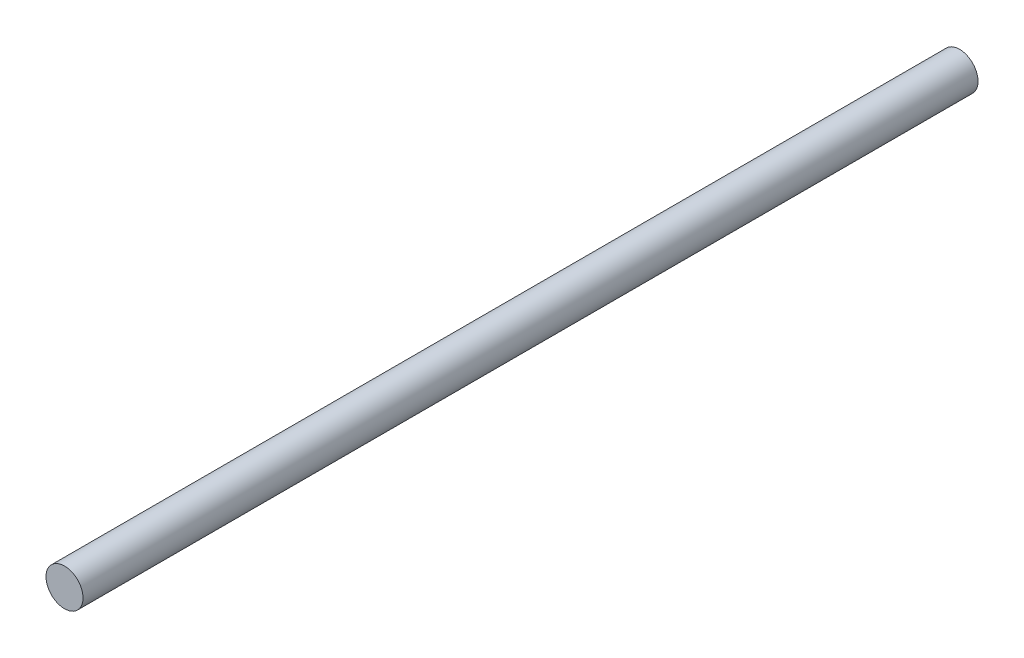
ISO-10303-21;
HEADER;
FILE_DESCRIPTION(('STEP AP214'),'2;1');
FILE_NAME('part.step','',(''),(''),'','','');
FILE_SCHEMA(('AUTOMOTIVE_DESIGN { 1 0 10303 214 1 1 1 1 }'));
ENDSEC;
DATA;
#1=APPLICATION_CONTEXT('core data for automotive mechanical design processes');
#2=APPLICATION_PROTOCOL_DEFINITION('international standard','automotive_design',2000,#1);
#3=PRODUCT_CONTEXT('',#1,'mechanical');
#4=PRODUCT('Part','Part','',(#3));
#5=PRODUCT_RELATED_PRODUCT_CATEGORY('part','',(#4));
#6=PRODUCT_DEFINITION_FORMATION('','',#4);
#7=PRODUCT_DEFINITION_CONTEXT('part definition',#1,'design');
#8=PRODUCT_DEFINITION('design','',#6,#7);
#9=PRODUCT_DEFINITION_SHAPE('','',#8);
#10=(LENGTH_UNIT() NAMED_UNIT(*) SI_UNIT(.MILLI.,.METRE.));
#11=(NAMED_UNIT(*) PLANE_ANGLE_UNIT() SI_UNIT($,.RADIAN.));
#12=(NAMED_UNIT(*) SI_UNIT($,.STERADIAN.) SOLID_ANGLE_UNIT());
#13=UNCERTAINTY_MEASURE_WITH_UNIT(LENGTH_MEASURE(1.E-05),#10,'distance_accuracy_value','');
#14=(GEOMETRIC_REPRESENTATION_CONTEXT(3) GLOBAL_UNCERTAINTY_ASSIGNED_CONTEXT((#13)) GLOBAL_UNIT_ASSIGNED_CONTEXT((#10,
#11,#12)) REPRESENTATION_CONTEXT('',''));
#15=CARTESIAN_POINT('',(0.,0.,0.));
#16=DIRECTION('',(0.,0.,1.));
#17=DIRECTION('',(1.,0.,0.));
#18=AXIS2_PLACEMENT_3D('',#15,#16,#17);
#19=CARTESIAN_POINT('',(0.,0.,250.));
#20=DIRECTION('',(0.,0.,-1.));
#21=DIRECTION('',(-1.,0.,0.));
#22=AXIS2_PLACEMENT_3D('',#19,#20,#21);
#23=CYLINDRICAL_SURFACE('',#22,6.);
#24=CARTESIAN_POINT('',(0.,0.,250.));
#25=DIRECTION('',(0.,0.,1.));
#26=DIRECTION('',(1.,0.,0.));
#27=AXIS2_PLACEMENT_3D('',#24,#25,#26);
#28=CIRCLE('',#27,6.);
#29=CARTESIAN_POINT('',(6.,0.,250.));
#30=VERTEX_POINT('',#29);
#31=EDGE_CURVE('E10',#30,#30,#28,.T.);
#32=ORIENTED_EDGE('',*,*,#31,.F.);
#33=EDGE_LOOP('',(#32));
#34=FACE_BOUND('',#33,.T.);
#35=CARTESIAN_POINT('',(0.,0.,-40.));
#36=DIRECTION('',(0.,0.,-1.));
#37=DIRECTION('',(-1.,0.,0.));
#38=AXIS2_PLACEMENT_3D('',#35,#36,#37);
#39=CIRCLE('',#38,6.);
#40=CARTESIAN_POINT('',(-6.,0.,-40.));
#41=VERTEX_POINT('',#40);
#42=EDGE_CURVE('E45',#41,#41,#39,.T.);
#43=ORIENTED_EDGE('',*,*,#42,.F.);
#44=EDGE_LOOP('',(#43));
#45=FACE_BOUND('',#44,.T.);
#46=ADVANCED_FACE('F39',(#34,#45),#23,.T.);
#47=CARTESIAN_POINT('',(0.,0.,250.));
#48=DIRECTION('',(0.,0.,1.));
#49=DIRECTION('',(1.,0.,0.));
#50=AXIS2_PLACEMENT_3D('',#47,#48,#49);
#51=PLANE('',#50);
#52=ORIENTED_EDGE('',*,*,#31,.T.);
#53=EDGE_LOOP('',(#52));
#54=FACE_BOUND('',#53,.T.);
#55=ADVANCED_FACE('F54',(#54),#51,.T.);
#56=CARTESIAN_POINT('',(0.,0.,-40.));
#57=DIRECTION('',(0.,0.,-1.));
#58=DIRECTION('',(-1.,0.,0.));
#59=AXIS2_PLACEMENT_3D('',#56,#57,#58);
#60=PLANE('',#59);
#61=ORIENTED_EDGE('',*,*,#42,.T.);
#62=EDGE_LOOP('',(#61));
#63=FACE_BOUND('',#62,.T.);
#64=ADVANCED_FACE('F51',(#63),#60,.T.);
#65=CLOSED_SHELL('',(#46,#55,#64));
#66=MANIFOLD_SOLID_BREP('B2',#65);
#67=ADVANCED_BREP_SHAPE_REPRESENTATION('',(#18,#66),#14);
#68=SHAPE_DEFINITION_REPRESENTATION(#9,#67);
ENDSEC;
END-ISO-10303-21;
